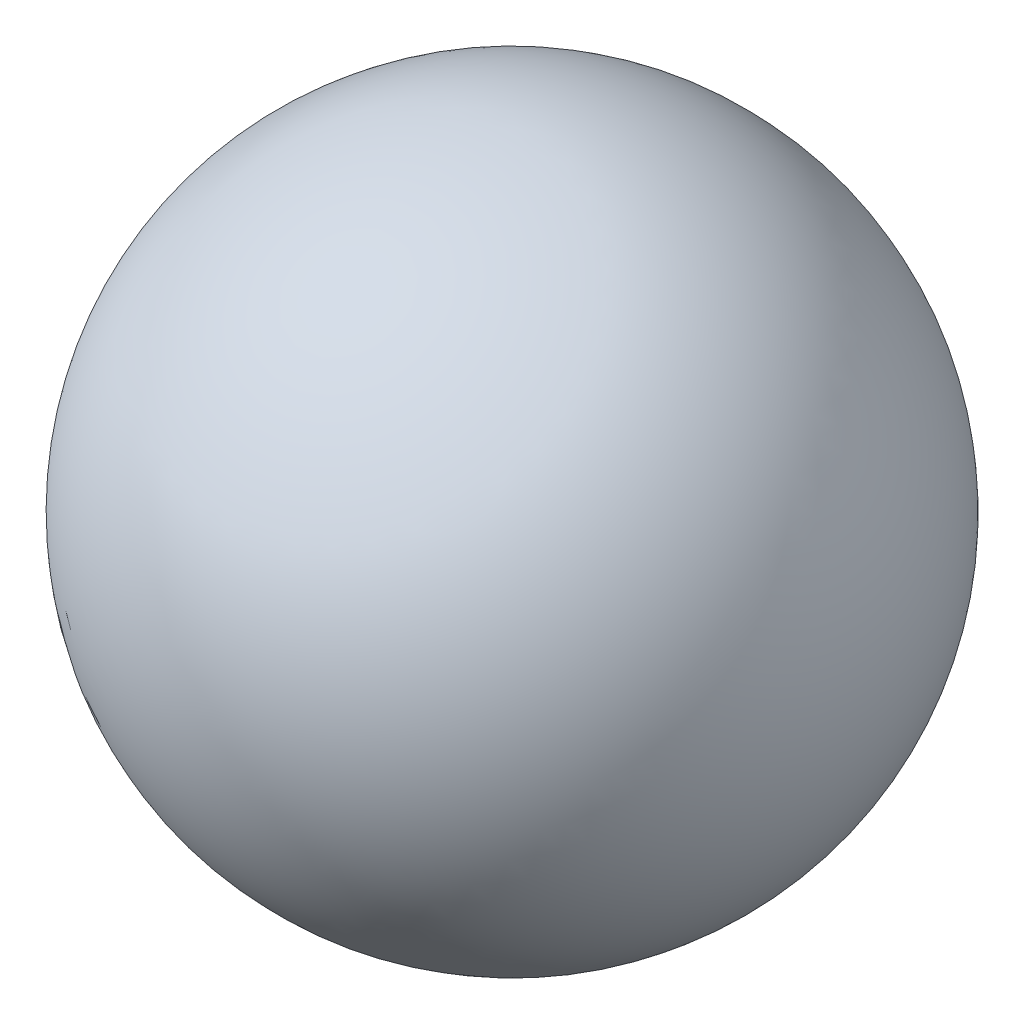
ISO-10303-21;
HEADER;
FILE_DESCRIPTION(('STEP AP214'),'2;1');
FILE_NAME('part.step','',(''),(''),'','','');
FILE_SCHEMA(('AUTOMOTIVE_DESIGN { 1 0 10303 214 1 1 1 1 }'));
ENDSEC;
DATA;
#1=APPLICATION_CONTEXT('core data for automotive mechanical design processes');
#2=APPLICATION_PROTOCOL_DEFINITION('international standard','automotive_design',2000,#1);
#3=PRODUCT_CONTEXT('',#1,'mechanical');
#4=PRODUCT('Part','Part','',(#3));
#5=PRODUCT_RELATED_PRODUCT_CATEGORY('part','',(#4));
#6=PRODUCT_DEFINITION_FORMATION('','',#4);
#7=PRODUCT_DEFINITION_CONTEXT('part definition',#1,'design');
#8=PRODUCT_DEFINITION('design','',#6,#7);
#9=PRODUCT_DEFINITION_SHAPE('','',#8);
#10=(LENGTH_UNIT() NAMED_UNIT(*) SI_UNIT(.MILLI.,.METRE.));
#11=(NAMED_UNIT(*) PLANE_ANGLE_UNIT() SI_UNIT($,.RADIAN.));
#12=(NAMED_UNIT(*) SI_UNIT($,.STERADIAN.) SOLID_ANGLE_UNIT());
#13=UNCERTAINTY_MEASURE_WITH_UNIT(LENGTH_MEASURE(1.E-05),#10,'distance_accuracy_value','');
#14=(GEOMETRIC_REPRESENTATION_CONTEXT(3) GLOBAL_UNCERTAINTY_ASSIGNED_CONTEXT((#13)) GLOBAL_UNIT_ASSIGNED_CONTEXT((#10,
#11,#12)) REPRESENTATION_CONTEXT('',''));
#15=CARTESIAN_POINT('',(0.,0.,0.));
#16=DIRECTION('',(0.,0.,1.));
#17=DIRECTION('',(1.,0.,0.));
#18=AXIS2_PLACEMENT_3D('',#15,#16,#17);
#19=CARTESIAN_POINT('',(0.,0.,0.));
#20=DIRECTION('',(0.414173248347773,0.647363016778155,0.639829387306445));
#21=DIRECTION('',(-0.569112768669381,-0.364411272281136,0.737099098610164));
#22=AXIS2_PLACEMENT_3D('',#19,#20,#21);
#23=SPHERICAL_SURFACE('',#22,1.1905);
#24=CARTESIAN_POINT('',(0.493073252158023,0.770685671474394,0.761716885588322));
#25=VERTEX_POINT('',#24);
#26=VERTEX_LOOP('',#25);
#27=FACE_BOUND('',#26,.T.);
#28=CARTESIAN_POINT('',(-0.493073252158024,-0.770685671474394,-0.761716885588322));
#29=VERTEX_POINT('',#28);
#30=VERTEX_LOOP('',#29);
#31=FACE_BOUND('',#30,.T.);
#32=ADVANCED_FACE('F15',(#27,#31),#23,.T.);
#33=CLOSED_SHELL('',(#32));
#34=MANIFOLD_SOLID_BREP('B1',#33);
#35=ADVANCED_BREP_SHAPE_REPRESENTATION('',(#18,#34),#14);
#36=SHAPE_DEFINITION_REPRESENTATION(#9,#35);
ENDSEC;
END-ISO-10303-21;
